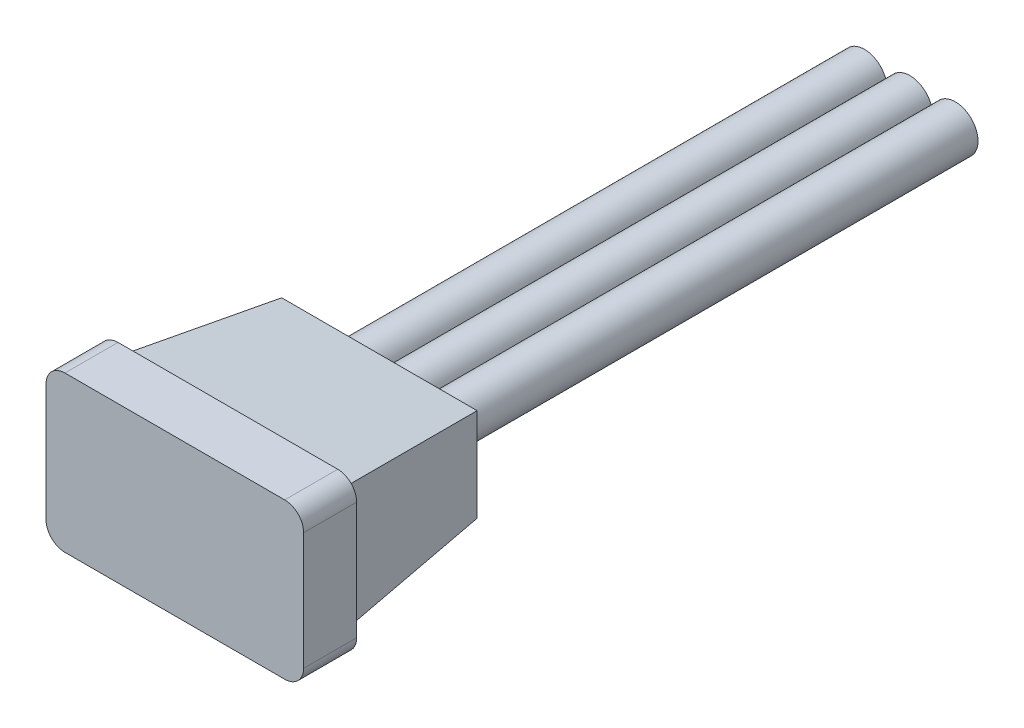
ISO-10303-21;
HEADER;
FILE_DESCRIPTION(('STEP AP214'),'2;1');
FILE_NAME('part.step','',(''),(''),'','','');
FILE_SCHEMA(('AUTOMOTIVE_DESIGN { 1 0 10303 214 1 1 1 1 }'));
ENDSEC;
DATA;
#1=APPLICATION_CONTEXT('core data for automotive mechanical design processes');
#2=APPLICATION_PROTOCOL_DEFINITION('international standard','automotive_design',2000,#1);
#3=PRODUCT_CONTEXT('',#1,'mechanical');
#4=PRODUCT('Part','Part','',(#3));
#5=PRODUCT_RELATED_PRODUCT_CATEGORY('part','',(#4));
#6=PRODUCT_DEFINITION_FORMATION('','',#4);
#7=PRODUCT_DEFINITION_CONTEXT('part definition',#1,'design');
#8=PRODUCT_DEFINITION('design','',#6,#7);
#9=PRODUCT_DEFINITION_SHAPE('','',#8);
#10=(LENGTH_UNIT() NAMED_UNIT(*) SI_UNIT(.MILLI.,.METRE.));
#11=(NAMED_UNIT(*) PLANE_ANGLE_UNIT() SI_UNIT($,.RADIAN.));
#12=(NAMED_UNIT(*) SI_UNIT($,.STERADIAN.) SOLID_ANGLE_UNIT());
#13=UNCERTAINTY_MEASURE_WITH_UNIT(LENGTH_MEASURE(1.E-05),#10,'distance_accuracy_value','');
#14=(GEOMETRIC_REPRESENTATION_CONTEXT(3) GLOBAL_UNCERTAINTY_ASSIGNED_CONTEXT((#13)) GLOBAL_UNIT_ASSIGNED_CONTEXT((#10,
#11,#12)) REPRESENTATION_CONTEXT('',''));
#15=CARTESIAN_POINT('',(0.,0.,0.));
#16=DIRECTION('',(0.,0.,1.));
#17=DIRECTION('',(1.,0.,0.));
#18=AXIS2_PLACEMENT_3D('',#15,#16,#17);
#19=CARTESIAN_POINT('',(1.2,0.,-21.0970562748477));
#20=DIRECTION('',(0.,0.,1.));
#21=DIRECTION('',(1.,0.,0.));
#22=AXIS2_PLACEMENT_3D('',#19,#20,#21);
#23=CYLINDRICAL_SURFACE('',#22,0.6);
#24=CARTESIAN_POINT('',(1.2,0.,-5.4));
#25=DIRECTION('',(0.,0.,-1.));
#26=DIRECTION('',(-1.,0.,0.));
#27=AXIS2_PLACEMENT_3D('',#24,#25,#26);
#28=CIRCLE('',#27,0.6);
#29=CARTESIAN_POINT('',(0.6,0.,-5.4));
#30=VERTEX_POINT('',#29);
#31=EDGE_CURVE('E63',#30,#30,#28,.T.);
#32=ORIENTED_EDGE('',*,*,#31,.T.);
#33=EDGE_LOOP('',(#32));
#34=FACE_BOUND('',#33,.T.);
#35=CARTESIAN_POINT('',(1.2,0.,-19.4));
#36=DIRECTION('',(0.,0.,-1.));
#37=DIRECTION('',(-1.,0.,0.));
#38=AXIS2_PLACEMENT_3D('',#35,#36,#37);
#39=CIRCLE('',#38,0.6);
#40=CARTESIAN_POINT('',(0.6,0.,-19.4));
#41=VERTEX_POINT('',#40);
#42=EDGE_CURVE('E13',#41,#41,#39,.T.);
#43=ORIENTED_EDGE('',*,*,#42,.F.);
#44=EDGE_LOOP('',(#43));
#45=FACE_BOUND('',#44,.T.);
#46=ADVANCED_FACE('F56',(#34,#45),#23,.T.);
#47=CARTESIAN_POINT('',(1.2,0.,-5.4));
#48=DIRECTION('',(0.,0.,-1.));
#49=DIRECTION('',(-1.,0.,0.));
#50=AXIS2_PLACEMENT_3D('',#47,#48,#49);
#51=PLANE('',#50);
#52=ORIENTED_EDGE('',*,*,#31,.F.);
#53=EDGE_LOOP('',(#52));
#54=FACE_BOUND('',#53,.T.);
#55=ADVANCED_FACE('F71',(#54),#51,.F.);
#56=CARTESIAN_POINT('',(0.,0.,-19.4));
#57=DIRECTION('',(0.,0.,-1.));
#58=DIRECTION('',(-1.,0.,0.));
#59=AXIS2_PLACEMENT_3D('',#56,#57,#58);
#60=PLANE('',#59);
#61=ORIENTED_EDGE('',*,*,#42,.T.);
#62=EDGE_LOOP('',(#61));
#63=FACE_BOUND('',#62,.T.);
#64=ADVANCED_FACE('F58',(#63),#60,.T.);
#65=CLOSED_SHELL('',(#46,#55,#64));
#66=MANIFOLD_SOLID_BREP('B2',#65);
#67=CARTESIAN_POINT('',(-1.2,0.,-21.0970562748477));
#68=DIRECTION('',(0.,0.,1.));
#69=DIRECTION('',(1.,0.,0.));
#70=AXIS2_PLACEMENT_3D('',#67,#68,#69);
#71=CYLINDRICAL_SURFACE('',#70,0.6);
#72=CARTESIAN_POINT('',(-1.2,0.,-5.4));
#73=DIRECTION('',(0.,0.,-1.));
#74=DIRECTION('',(-1.,0.,0.));
#75=AXIS2_PLACEMENT_3D('',#72,#73,#74);
#76=CIRCLE('',#75,0.6);
#77=CARTESIAN_POINT('',(-1.8,0.,-5.4));
#78=VERTEX_POINT('',#77);
#79=EDGE_CURVE('E120',#78,#78,#76,.T.);
#80=ORIENTED_EDGE('',*,*,#79,.T.);
#81=EDGE_LOOP('',(#80));
#82=FACE_BOUND('',#81,.T.);
#83=CARTESIAN_POINT('',(-1.2,0.,-19.4));
#84=DIRECTION('',(0.,0.,-1.));
#85=DIRECTION('',(-1.,0.,0.));
#86=AXIS2_PLACEMENT_3D('',#83,#84,#85);
#87=CIRCLE('',#86,0.6);
#88=CARTESIAN_POINT('',(-1.8,0.,-19.4));
#89=VERTEX_POINT('',#88);
#90=EDGE_CURVE('E55',#89,#89,#87,.T.);
#91=ORIENTED_EDGE('',*,*,#90,.F.);
#92=EDGE_LOOP('',(#91));
#93=FACE_BOUND('',#92,.T.);
#94=ADVANCED_FACE('F113',(#82,#93),#71,.T.);
#95=CARTESIAN_POINT('',(-1.2,0.,-5.4));
#96=DIRECTION('',(0.,0.,-1.));
#97=DIRECTION('',(-1.,0.,0.));
#98=AXIS2_PLACEMENT_3D('',#95,#96,#97);
#99=PLANE('',#98);
#100=ORIENTED_EDGE('',*,*,#79,.F.);
#101=EDGE_LOOP('',(#100));
#102=FACE_BOUND('',#101,.T.);
#103=ADVANCED_FACE('F128',(#102),#99,.F.);
#104=CARTESIAN_POINT('',(0.,0.,-19.4));
#105=DIRECTION('',(0.,0.,-1.));
#106=DIRECTION('',(-1.,0.,0.));
#107=AXIS2_PLACEMENT_3D('',#104,#105,#106);
#108=PLANE('',#107);
#109=ORIENTED_EDGE('',*,*,#90,.T.);
#110=EDGE_LOOP('',(#109));
#111=FACE_BOUND('',#110,.T.);
#112=ADVANCED_FACE('F115',(#111),#108,.T.);
#113=CLOSED_SHELL('',(#94,#103,#112));
#114=MANIFOLD_SOLID_BREP('B8',#113);
#115=CARTESIAN_POINT('',(0.,0.,-19.4));
#116=DIRECTION('',(0.,0.,1.));
#117=DIRECTION('',(1.,0.,0.));
#118=AXIS2_PLACEMENT_3D('',#115,#116,#117);
#119=CYLINDRICAL_SURFACE('',#118,0.6);
#120=CARTESIAN_POINT('',(0.,0.,-19.4));
#121=DIRECTION('',(0.,0.,-1.));
#122=DIRECTION('',(-1.,0.,0.));
#123=AXIS2_PLACEMENT_3D('',#120,#121,#122);
#124=CIRCLE('',#123,0.6);
#125=CARTESIAN_POINT('',(-0.6,0.,-19.4));
#126=VERTEX_POINT('',#125);
#127=EDGE_CURVE('E112',#126,#126,#124,.T.);
#128=ORIENTED_EDGE('',*,*,#127,.F.);
#129=EDGE_LOOP('',(#128));
#130=FACE_BOUND('',#129,.T.);
#131=CARTESIAN_POINT('',(0.,0.,-5.4));
#132=DIRECTION('',(0.,0.,-1.));
#133=DIRECTION('',(-1.,0.,0.));
#134=AXIS2_PLACEMENT_3D('',#131,#132,#133);
#135=CIRCLE('',#134,0.6);
#136=CARTESIAN_POINT('',(-0.6,0.,-5.4));
#137=VERTEX_POINT('',#136);
#138=EDGE_CURVE('E172',#137,#137,#135,.T.);
#139=ORIENTED_EDGE('',*,*,#138,.T.);
#140=EDGE_LOOP('',(#139));
#141=FACE_BOUND('',#140,.T.);
#142=ADVANCED_FACE('F169',(#130,#141),#119,.T.);
#143=CARTESIAN_POINT('',(0.,0.,-19.4));
#144=DIRECTION('',(0.,0.,-1.));
#145=DIRECTION('',(-1.,0.,0.));
#146=AXIS2_PLACEMENT_3D('',#143,#144,#145);
#147=PLANE('',#146);
#148=ORIENTED_EDGE('',*,*,#127,.T.);
#149=EDGE_LOOP('',(#148));
#150=FACE_BOUND('',#149,.T.);
#151=ADVANCED_FACE('F184',(#150),#147,.T.);
#152=CARTESIAN_POINT('',(0.,0.,-5.4));
#153=DIRECTION('',(0.,0.,-1.));
#154=DIRECTION('',(-1.,0.,0.));
#155=AXIS2_PLACEMENT_3D('',#152,#153,#154);
#156=PLANE('',#155);
#157=ORIENTED_EDGE('',*,*,#138,.F.);
#158=EDGE_LOOP('',(#157));
#159=FACE_BOUND('',#158,.T.);
#160=ADVANCED_FACE('F182',(#159),#156,.F.);
#161=CLOSED_SHELL('',(#142,#151,#160));
#162=MANIFOLD_SOLID_BREP('B50',#161);
#163=CARTESIAN_POINT('',(0.,0.,-1.4));
#164=DIRECTION('',(0.,0.,1.));
#165=DIRECTION('',(1.,0.,0.));
#166=AXIS2_PLACEMENT_3D('',#163,#164,#165);
#167=PLANE('',#166);
#168=DIRECTION('',(1.,0.,0.));
#169=VECTOR('',#168,1.);
#170=CARTESIAN_POINT('',(-3.4,-2.05,-1.4));
#171=LINE('',#170,#169);
#172=CARTESIAN_POINT('',(-2.9,-2.05,-1.4));
#173=VERTEX_POINT('',#172);
#174=CARTESIAN_POINT('',(2.9,-2.05,-1.4));
#175=VERTEX_POINT('',#174);
#176=EDGE_CURVE('E348',#173,#175,#171,.T.);
#177=ORIENTED_EDGE('',*,*,#176,.F.);
#178=CARTESIAN_POINT('',(-2.9,-1.55,-1.4));
#179=DIRECTION('',(0.,0.,1.));
#180=DIRECTION('',(1.,0.,0.));
#181=AXIS2_PLACEMENT_3D('',#178,#179,#180);
#182=CIRCLE('',#181,0.5);
#183=CARTESIAN_POINT('',(-3.4,-1.55,-1.4));
#184=VERTEX_POINT('',#183);
#185=EDGE_CURVE('E385',#173,#184,#182,.F.);
#186=ORIENTED_EDGE('',*,*,#185,.T.);
#187=DIRECTION('',(0.,-1.,0.));
#188=VECTOR('',#187,1.);
#189=CARTESIAN_POINT('',(-3.4,2.05,-1.4));
#190=LINE('',#189,#188);
#191=CARTESIAN_POINT('',(-3.4,1.55,-1.4));
#192=VERTEX_POINT('',#191);
#193=EDGE_CURVE('E345',#192,#184,#190,.T.);
#194=ORIENTED_EDGE('',*,*,#193,.F.);
#195=CARTESIAN_POINT('',(-2.9,1.55,-1.4));
#196=DIRECTION('',(0.,0.,1.));
#197=DIRECTION('',(1.,0.,0.));
#198=AXIS2_PLACEMENT_3D('',#195,#196,#197);
#199=CIRCLE('',#198,0.5);
#200=CARTESIAN_POINT('',(-2.9,2.05,-1.4));
#201=VERTEX_POINT('',#200);
#202=EDGE_CURVE('E225',#192,#201,#199,.F.);
#203=ORIENTED_EDGE('',*,*,#202,.T.);
#204=DIRECTION('',(-1.,0.,0.));
#205=VECTOR('',#204,1.);
#206=CARTESIAN_POINT('',(-3.4,2.05,-1.4));
#207=LINE('',#206,#205);
#208=CARTESIAN_POINT('',(2.9,2.05,-1.4));
#209=VERTEX_POINT('',#208);
#210=EDGE_CURVE('E342',#209,#201,#207,.T.);
#211=ORIENTED_EDGE('',*,*,#210,.F.);
#212=CARTESIAN_POINT('',(2.9,1.55,-1.4));
#213=DIRECTION('',(0.,0.,1.));
#214=DIRECTION('',(1.,0.,0.));
#215=AXIS2_PLACEMENT_3D('',#212,#213,#214);
#216=CIRCLE('',#215,0.5);
#217=CARTESIAN_POINT('',(3.4,1.55,-1.4));
#218=VERTEX_POINT('',#217);
#219=EDGE_CURVE('E380',#209,#218,#216,.F.);
#220=ORIENTED_EDGE('',*,*,#219,.T.);
#221=DIRECTION('',(0.,1.,0.));
#222=VECTOR('',#221,1.);
#223=CARTESIAN_POINT('',(3.4,2.05,-1.4));
#224=LINE('',#223,#222);
#225=CARTESIAN_POINT('',(3.4,-1.55,-1.4));
#226=VERTEX_POINT('',#225);
#227=EDGE_CURVE('E339',#226,#218,#224,.T.);
#228=ORIENTED_EDGE('',*,*,#227,.F.);
#229=CARTESIAN_POINT('',(2.9,-1.55,-1.4));
#230=DIRECTION('',(0.,0.,1.));
#231=DIRECTION('',(1.,0.,0.));
#232=AXIS2_PLACEMENT_3D('',#229,#230,#231);
#233=CIRCLE('',#232,0.5);
#234=EDGE_CURVE('E382',#226,#175,#233,.F.);
#235=ORIENTED_EDGE('',*,*,#234,.T.);
#236=EDGE_LOOP('',(#177,#186,#194,#203,#211,#220,#228,#235));
#237=FACE_BOUND('',#236,.T.);
#238=DIRECTION('',(0.,-1.,0.));
#239=VECTOR('',#238,1.);
#240=CARTESIAN_POINT('',(3.,1.65,-1.4));
#241=LINE('',#240,#239);
#242=CARTESIAN_POINT('',(3.,1.65,-1.4));
#243=VERTEX_POINT('',#242);
#244=CARTESIAN_POINT('',(3.,-1.65,-1.4));
#245=VERTEX_POINT('',#244);
#246=EDGE_CURVE('E299',#243,#245,#241,.T.);
#247=ORIENTED_EDGE('',*,*,#246,.F.);
#248=DIRECTION('',(1.,0.,0.));
#249=VECTOR('',#248,1.);
#250=CARTESIAN_POINT('',(-3.,1.65,-1.4));
#251=LINE('',#250,#249);
#252=CARTESIAN_POINT('',(-3.,1.65,-1.4));
#253=VERTEX_POINT('',#252);
#254=EDGE_CURVE('E301',#253,#243,#251,.T.);
#255=ORIENTED_EDGE('',*,*,#254,.F.);
#256=DIRECTION('',(0.,1.,0.));
#257=VECTOR('',#256,1.);
#258=CARTESIAN_POINT('',(-3.,1.65,-1.4));
#259=LINE('',#258,#257);
#260=CARTESIAN_POINT('',(-3.,-1.65,-1.4));
#261=VERTEX_POINT('',#260);
#262=EDGE_CURVE('E320',#261,#253,#259,.T.);
#263=ORIENTED_EDGE('',*,*,#262,.F.);
#264=DIRECTION('',(-1.,0.,0.));
#265=VECTOR('',#264,1.);
#266=CARTESIAN_POINT('',(-3.,-1.65,-1.4));
#267=LINE('',#266,#265);
#268=EDGE_CURVE('E304',#245,#261,#267,.T.);
#269=ORIENTED_EDGE('',*,*,#268,.F.);
#270=EDGE_LOOP('',(#247,#255,#263,#269));
#271=FACE_BOUND('',#270,.T.);
#272=ADVANCED_FACE('F210',(#237,#271),#167,.F.);
#273=CARTESIAN_POINT('',(3.4,2.05,-1.4));
#274=DIRECTION('',(1.,0.,0.));
#275=DIRECTION('',(0.,1.,0.));
#276=AXIS2_PLACEMENT_3D('',#273,#274,#275);
#277=PLANE('',#276);
#278=DIRECTION('',(0.,1.,0.));
#279=VECTOR('',#278,1.);
#280=CARTESIAN_POINT('',(3.4,2.05,0.));
#281=LINE('',#280,#279);
#282=CARTESIAN_POINT('',(3.4,-1.55,0.));
#283=VERTEX_POINT('',#282);
#284=CARTESIAN_POINT('',(3.4,1.55,0.));
#285=VERTEX_POINT('',#284);
#286=EDGE_CURVE('E352',#283,#285,#281,.T.);
#287=ORIENTED_EDGE('',*,*,#286,.F.);
#288=DIRECTION('',(0.,0.,1.));
#289=VECTOR('',#288,1.);
#290=CARTESIAN_POINT('',(3.4,-1.55,-1.4));
#291=LINE('',#290,#289);
#292=EDGE_CURVE('E167',#283,#226,#291,.F.);
#293=ORIENTED_EDGE('',*,*,#292,.T.);
#294=ORIENTED_EDGE('',*,*,#227,.T.);
#295=DIRECTION('',(0.,0.,1.));
#296=VECTOR('',#295,1.);
#297=CARTESIAN_POINT('',(3.4,1.55,-1.4));
#298=LINE('',#297,#296);
#299=EDGE_CURVE('E218',#218,#285,#298,.T.);
#300=ORIENTED_EDGE('',*,*,#299,.T.);
#301=EDGE_LOOP('',(#287,#293,#294,#300));
#302=FACE_BOUND('',#301,.T.);
#303=ADVANCED_FACE('F394',(#302),#277,.T.);
#304=CARTESIAN_POINT('',(-3.4,-2.05,-1.4));
#305=DIRECTION('',(0.,-1.,0.));
#306=DIRECTION('',(0.,0.,-1.));
#307=AXIS2_PLACEMENT_3D('',#304,#305,#306);
#308=PLANE('',#307);
#309=DIRECTION('',(1.,0.,0.));
#310=VECTOR('',#309,1.);
#311=CARTESIAN_POINT('',(-3.4,-2.05,0.));
#312=LINE('',#311,#310);
#313=CARTESIAN_POINT('',(-2.9,-2.05,0.));
#314=VERTEX_POINT('',#313);
#315=CARTESIAN_POINT('',(2.9,-2.05,0.));
#316=VERTEX_POINT('',#315);
#317=EDGE_CURVE('E343',#314,#316,#312,.T.);
#318=ORIENTED_EDGE('',*,*,#317,.F.);
#319=DIRECTION('',(0.,0.,1.));
#320=VECTOR('',#319,1.);
#321=CARTESIAN_POINT('',(-2.9,-2.05,-1.4));
#322=LINE('',#321,#320);
#323=EDGE_CURVE('E378',#314,#173,#322,.F.);
#324=ORIENTED_EDGE('',*,*,#323,.T.);
#325=ORIENTED_EDGE('',*,*,#176,.T.);
#326=DIRECTION('',(0.,0.,1.));
#327=VECTOR('',#326,1.);
#328=CARTESIAN_POINT('',(2.9,-2.05,-1.4));
#329=LINE('',#328,#327);
#330=EDGE_CURVE('E375',#175,#316,#329,.T.);
#331=ORIENTED_EDGE('',*,*,#330,.T.);
#332=EDGE_LOOP('',(#318,#324,#325,#331));
#333=FACE_BOUND('',#332,.T.);
#334=ADVANCED_FACE('F407',(#333),#308,.T.);
#335=CARTESIAN_POINT('',(-3.4,2.05,-1.4));
#336=DIRECTION('',(-1.,0.,0.));
#337=DIRECTION('',(0.,-1.,0.));
#338=AXIS2_PLACEMENT_3D('',#335,#336,#337);
#339=PLANE('',#338);
#340=ORIENTED_EDGE('',*,*,#193,.T.);
#341=DIRECTION('',(0.,0.,1.));
#342=VECTOR('',#341,1.);
#343=CARTESIAN_POINT('',(-3.4,-1.55,-1.4));
#344=LINE('',#343,#342);
#345=CARTESIAN_POINT('',(-3.4,-1.55,0.));
#346=VERTEX_POINT('',#345);
#347=EDGE_CURVE('E364',#184,#346,#344,.T.);
#348=ORIENTED_EDGE('',*,*,#347,.T.);
#349=DIRECTION('',(0.,-1.,0.));
#350=VECTOR('',#349,1.);
#351=CARTESIAN_POINT('',(-3.4,2.05,0.));
#352=LINE('',#351,#350);
#353=CARTESIAN_POINT('',(-3.4,1.55,0.));
#354=VERTEX_POINT('',#353);
#355=EDGE_CURVE('E358',#354,#346,#352,.T.);
#356=ORIENTED_EDGE('',*,*,#355,.F.);
#357=DIRECTION('',(0.,0.,1.));
#358=VECTOR('',#357,1.);
#359=CARTESIAN_POINT('',(-3.4,1.55,-1.4));
#360=LINE('',#359,#358);
#361=EDGE_CURVE('E351',#354,#192,#360,.F.);
#362=ORIENTED_EDGE('',*,*,#361,.T.);
#363=EDGE_LOOP('',(#340,#348,#356,#362));
#364=FACE_BOUND('',#363,.T.);
#365=ADVANCED_FACE('F416',(#364),#339,.T.);
#366=CARTESIAN_POINT('',(-3.4,2.05,-1.4));
#367=DIRECTION('',(0.,1.,0.));
#368=DIRECTION('',(0.,0.,1.));
#369=AXIS2_PLACEMENT_3D('',#366,#367,#368);
#370=PLANE('',#369);
#371=ORIENTED_EDGE('',*,*,#210,.T.);
#372=DIRECTION('',(0.,0.,1.));
#373=VECTOR('',#372,1.);
#374=CARTESIAN_POINT('',(-2.9,2.05,-1.4));
#375=LINE('',#374,#373);
#376=CARTESIAN_POINT('',(-2.9,2.05,0.));
#377=VERTEX_POINT('',#376);
#378=EDGE_CURVE('E388',#201,#377,#375,.T.);
#379=ORIENTED_EDGE('',*,*,#378,.T.);
#380=DIRECTION('',(-1.,0.,0.));
#381=VECTOR('',#380,1.);
#382=CARTESIAN_POINT('',(-3.4,2.05,0.));
#383=LINE('',#382,#381);
#384=CARTESIAN_POINT('',(2.9,2.05,0.));
#385=VERTEX_POINT('',#384);
#386=EDGE_CURVE('E355',#385,#377,#383,.T.);
#387=ORIENTED_EDGE('',*,*,#386,.F.);
#388=DIRECTION('',(0.,0.,1.));
#389=VECTOR('',#388,1.);
#390=CARTESIAN_POINT('',(2.9,2.05,-1.4));
#391=LINE('',#390,#389);
#392=EDGE_CURVE('E232',#385,#209,#391,.F.);
#393=ORIENTED_EDGE('',*,*,#392,.T.);
#394=EDGE_LOOP('',(#371,#379,#387,#393));
#395=FACE_BOUND('',#394,.T.);
#396=ADVANCED_FACE('F421',(#395),#370,.T.);
#397=CARTESIAN_POINT('',(0.,0.,0.));
#398=DIRECTION('',(0.,0.,1.));
#399=DIRECTION('',(1.,0.,0.));
#400=AXIS2_PLACEMENT_3D('',#397,#398,#399);
#401=PLANE('',#400);
#402=ORIENTED_EDGE('',*,*,#355,.T.);
#403=CARTESIAN_POINT('',(-2.9,-1.55,0.));
#404=DIRECTION('',(0.,0.,1.));
#405=DIRECTION('',(1.,0.,0.));
#406=AXIS2_PLACEMENT_3D('',#403,#404,#405);
#407=CIRCLE('',#406,0.5);
#408=EDGE_CURVE('E373',#346,#314,#407,.T.);
#409=ORIENTED_EDGE('',*,*,#408,.T.);
#410=ORIENTED_EDGE('',*,*,#317,.T.);
#411=CARTESIAN_POINT('',(2.9,-1.55,0.));
#412=DIRECTION('',(0.,0.,1.));
#413=DIRECTION('',(1.,0.,0.));
#414=AXIS2_PLACEMENT_3D('',#411,#412,#413);
#415=CIRCLE('',#414,0.5);
#416=EDGE_CURVE('E369',#316,#283,#415,.T.);
#417=ORIENTED_EDGE('',*,*,#416,.T.);
#418=ORIENTED_EDGE('',*,*,#286,.T.);
#419=CARTESIAN_POINT('',(2.9,1.55,0.));
#420=DIRECTION('',(0.,0.,1.));
#421=DIRECTION('',(1.,0.,0.));
#422=AXIS2_PLACEMENT_3D('',#419,#420,#421);
#423=CIRCLE('',#422,0.5);
#424=EDGE_CURVE('E367',#285,#385,#423,.T.);
#425=ORIENTED_EDGE('',*,*,#424,.T.);
#426=ORIENTED_EDGE('',*,*,#386,.T.);
#427=CARTESIAN_POINT('',(-2.9,1.55,0.));
#428=DIRECTION('',(0.,0.,1.));
#429=DIRECTION('',(1.,0.,0.));
#430=AXIS2_PLACEMENT_3D('',#427,#428,#429);
#431=CIRCLE('',#430,0.5);
#432=EDGE_CURVE('E371',#377,#354,#431,.T.);
#433=ORIENTED_EDGE('',*,*,#432,.T.);
#434=EDGE_LOOP('',(#402,#409,#410,#417,#418,#425,#426,#433));
#435=FACE_BOUND('',#434,.T.);
#436=ADVANCED_FACE('F400',(#435),#401,.T.);
#437=CARTESIAN_POINT('',(3.,1.65,-1.4));
#438=DIRECTION('',(0.994521895368273,0.,-0.104528463267654));
#439=DIRECTION('',(-0.104528463267654,0.,-0.994521895368273));
#440=AXIS2_PLACEMENT_3D('',#437,#438,#439);
#441=PLANE('',#440);
#442=ORIENTED_EDGE('',*,*,#246,.T.);
#443=DIRECTION('',(0.103962051184498,-0.103962051184498,0.989132844377854));
#444=VECTOR('',#443,1.);
#445=CARTESIAN_POINT('',(2.93515135148107,-1.58515135148107,-2.01699367637287));
#446=LINE('',#445,#444);
#447=CARTESIAN_POINT('',(2.57958305893729,-1.22958305893729,-5.4));
#448=VERTEX_POINT('',#447);
#449=EDGE_CURVE('E331',#448,#245,#446,.T.);
#450=ORIENTED_EDGE('',*,*,#449,.F.);
#451=DIRECTION('',(0.,1.,0.));
#452=VECTOR('',#451,1.);
#453=CARTESIAN_POINT('',(2.57958305893729,0.,-5.4));
#454=LINE('',#453,#452);
#455=CARTESIAN_POINT('',(2.57958305893729,1.22958305893729,-5.4));
#456=VERTEX_POINT('',#455);
#457=EDGE_CURVE('E319',#456,#448,#454,.F.);
#458=ORIENTED_EDGE('',*,*,#457,.F.);
#459=DIRECTION('',(0.103962051184498,0.103962051184498,0.989132844377854));
#460=VECTOR('',#459,1.);
#461=CARTESIAN_POINT('',(3.,1.65,-1.4));
#462=LINE('',#461,#460);
#463=EDGE_CURVE('E315',#456,#243,#462,.T.);
#464=ORIENTED_EDGE('',*,*,#463,.T.);
#465=EDGE_LOOP('',(#442,#450,#458,#464));
#466=FACE_BOUND('',#465,.T.);
#467=ADVANCED_FACE('F322',(#466),#441,.T.);
#468=CARTESIAN_POINT('',(-3.,-1.65,-1.4));
#469=DIRECTION('',(0.,-0.994521895368273,-0.104528463267654));
#470=DIRECTION('',(0.,0.104528463267654,-0.994521895368273));
#471=AXIS2_PLACEMENT_3D('',#468,#469,#470);
#472=PLANE('',#471);
#473=ORIENTED_EDGE('',*,*,#268,.T.);
#474=DIRECTION('',(-0.103962051184498,-0.103962051184498,0.989132844377854));
#475=VECTOR('',#474,1.);
#476=CARTESIAN_POINT('',(-2.96433324331459,-1.61433324331459,-1.73934652200508));
#477=LINE('',#476,#475);
#478=CARTESIAN_POINT('',(-2.57958305893729,-1.22958305893729,-5.4));
#479=VERTEX_POINT('',#478);
#480=EDGE_CURVE('E326',#479,#261,#477,.T.);
#481=ORIENTED_EDGE('',*,*,#480,.F.);
#482=DIRECTION('',(1.,0.,0.));
#483=VECTOR('',#482,1.);
#484=CARTESIAN_POINT('',(0.,-1.22958305893729,-5.4));
#485=LINE('',#484,#483);
#486=EDGE_CURVE('E336',#448,#479,#485,.F.);
#487=ORIENTED_EDGE('',*,*,#486,.F.);
#488=ORIENTED_EDGE('',*,*,#449,.T.);
#489=EDGE_LOOP('',(#473,#481,#487,#488));
#490=FACE_BOUND('',#489,.T.);
#491=ADVANCED_FACE('F434',(#490),#472,.T.);
#492=CARTESIAN_POINT('',(-3.,1.65,-1.4));
#493=DIRECTION('',(-0.994521895368273,0.,-0.104528463267654));
#494=DIRECTION('',(-0.104528463267654,0.,0.994521895368273));
#495=AXIS2_PLACEMENT_3D('',#492,#493,#494);
#496=PLANE('',#495);
#497=ORIENTED_EDGE('',*,*,#262,.T.);
#498=DIRECTION('',(-0.103962051184498,0.103962051184498,0.989132844377854));
#499=VECTOR('',#498,1.);
#500=CARTESIAN_POINT('',(-3.,1.65,-1.4));
#501=LINE('',#500,#499);
#502=CARTESIAN_POINT('',(-2.57958305893729,1.22958305893729,-5.4));
#503=VERTEX_POINT('',#502);
#504=EDGE_CURVE('E318',#503,#253,#501,.T.);
#505=ORIENTED_EDGE('',*,*,#504,.F.);
#506=DIRECTION('',(0.,-1.,0.));
#507=VECTOR('',#506,1.);
#508=CARTESIAN_POINT('',(-2.57958305893729,0.,-5.4));
#509=LINE('',#508,#507);
#510=EDGE_CURVE('E328',#479,#503,#509,.F.);
#511=ORIENTED_EDGE('',*,*,#510,.F.);
#512=ORIENTED_EDGE('',*,*,#480,.T.);
#513=EDGE_LOOP('',(#497,#505,#511,#512));
#514=FACE_BOUND('',#513,.T.);
#515=ADVANCED_FACE('F485',(#514),#496,.T.);
#516=CARTESIAN_POINT('',(-3.,1.65,-1.4));
#517=DIRECTION('',(0.,0.994521895368273,-0.104528463267654));
#518=DIRECTION('',(0.,0.104528463267654,0.994521895368273));
#519=AXIS2_PLACEMENT_3D('',#516,#517,#518);
#520=PLANE('',#519);
#521=ORIENTED_EDGE('',*,*,#254,.T.);
#522=ORIENTED_EDGE('',*,*,#463,.F.);
#523=DIRECTION('',(-1.,0.,0.));
#524=VECTOR('',#523,1.);
#525=CARTESIAN_POINT('',(0.,1.22958305893729,-5.4));
#526=LINE('',#525,#524);
#527=EDGE_CURVE('E324',#503,#456,#526,.F.);
#528=ORIENTED_EDGE('',*,*,#527,.F.);
#529=ORIENTED_EDGE('',*,*,#504,.T.);
#530=EDGE_LOOP('',(#521,#522,#528,#529));
#531=FACE_BOUND('',#530,.T.);
#532=ADVANCED_FACE('F313',(#531),#520,.T.);
#533=CARTESIAN_POINT('',(0.,0.,-5.4));
#534=DIRECTION('',(0.,0.,1.));
#535=DIRECTION('',(1.,0.,0.));
#536=AXIS2_PLACEMENT_3D('',#533,#534,#535);
#537=PLANE('',#536);
#538=ORIENTED_EDGE('',*,*,#457,.T.);
#539=ORIENTED_EDGE('',*,*,#486,.T.);
#540=ORIENTED_EDGE('',*,*,#510,.T.);
#541=ORIENTED_EDGE('',*,*,#527,.T.);
#542=EDGE_LOOP('',(#538,#539,#540,#541));
#543=FACE_BOUND('',#542,.T.);
#544=ADVANCED_FACE('F446',(#543),#537,.F.);
#545=CARTESIAN_POINT('',(-2.9,-1.55,-1.4));
#546=DIRECTION('',(0.,0.,1.));
#547=DIRECTION('',(1.,0.,0.));
#548=AXIS2_PLACEMENT_3D('',#545,#546,#547);
#549=CYLINDRICAL_SURFACE('',#548,0.5);
#550=ORIENTED_EDGE('',*,*,#185,.F.);
#551=ORIENTED_EDGE('',*,*,#323,.F.);
#552=ORIENTED_EDGE('',*,*,#408,.F.);
#553=ORIENTED_EDGE('',*,*,#347,.F.);
#554=EDGE_LOOP('',(#550,#551,#552,#553));
#555=FACE_BOUND('',#554,.T.);
#556=ADVANCED_FACE('F413',(#555),#549,.T.);
#557=CARTESIAN_POINT('',(-2.9,1.55,-1.4));
#558=DIRECTION('',(0.,0.,1.));
#559=DIRECTION('',(1.,0.,0.));
#560=AXIS2_PLACEMENT_3D('',#557,#558,#559);
#561=CYLINDRICAL_SURFACE('',#560,0.5);
#562=ORIENTED_EDGE('',*,*,#202,.F.);
#563=ORIENTED_EDGE('',*,*,#361,.F.);
#564=ORIENTED_EDGE('',*,*,#432,.F.);
#565=ORIENTED_EDGE('',*,*,#378,.F.);
#566=EDGE_LOOP('',(#562,#563,#564,#565));
#567=FACE_BOUND('',#566,.T.);
#568=ADVANCED_FACE('F420',(#567),#561,.T.);
#569=CARTESIAN_POINT('',(2.9,-1.55,-1.4));
#570=DIRECTION('',(0.,0.,1.));
#571=DIRECTION('',(1.,0.,0.));
#572=AXIS2_PLACEMENT_3D('',#569,#570,#571);
#573=CYLINDRICAL_SURFACE('',#572,0.5);
#574=ORIENTED_EDGE('',*,*,#234,.F.);
#575=ORIENTED_EDGE('',*,*,#292,.F.);
#576=ORIENTED_EDGE('',*,*,#416,.F.);
#577=ORIENTED_EDGE('',*,*,#330,.F.);
#578=EDGE_LOOP('',(#574,#575,#576,#577));
#579=FACE_BOUND('',#578,.T.);
#580=ADVANCED_FACE('F405',(#579),#573,.T.);
#581=CARTESIAN_POINT('',(2.9,1.55,-1.4));
#582=DIRECTION('',(0.,0.,1.));
#583=DIRECTION('',(1.,0.,0.));
#584=AXIS2_PLACEMENT_3D('',#581,#582,#583);
#585=CYLINDRICAL_SURFACE('',#584,0.5);
#586=ORIENTED_EDGE('',*,*,#219,.F.);
#587=ORIENTED_EDGE('',*,*,#392,.F.);
#588=ORIENTED_EDGE('',*,*,#424,.F.);
#589=ORIENTED_EDGE('',*,*,#299,.F.);
#590=EDGE_LOOP('',(#586,#587,#588,#589));
#591=FACE_BOUND('',#590,.T.);
#592=ADVANCED_FACE('F212',(#591),#585,.T.);
#593=CLOSED_SHELL('',(#272,#303,#334,#365,#396,#436,#467,#491,#515,#532,#544,#556,#568,#580,#592));
#594=MANIFOLD_SOLID_BREP('B107',#593);
#595=ADVANCED_BREP_SHAPE_REPRESENTATION('',(#18,#66,#114,#162,#594),#14);
#596=SHAPE_DEFINITION_REPRESENTATION(#9,#595);
ENDSEC;
END-ISO-10303-21;
